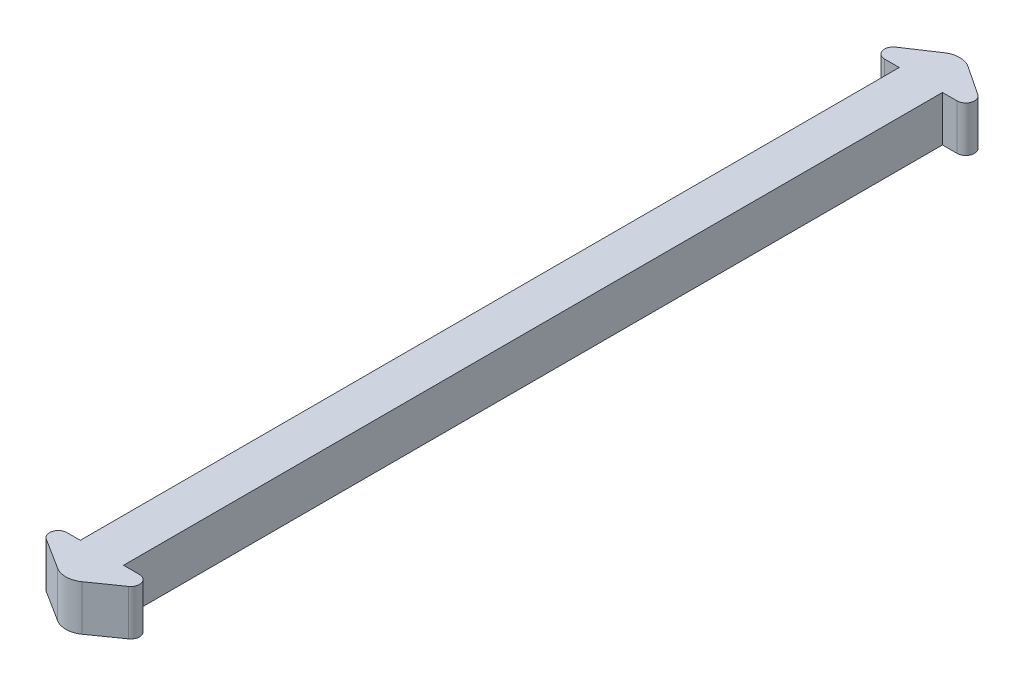
ISO-10303-21;
HEADER;
FILE_DESCRIPTION(('STEP AP214'),'2;1');
FILE_NAME('part.step','',(''),(''),'','','');
FILE_SCHEMA(('AUTOMOTIVE_DESIGN { 1 0 10303 214 1 1 1 1 }'));
ENDSEC;
DATA;
#1=APPLICATION_CONTEXT('core data for automotive mechanical design processes');
#2=APPLICATION_PROTOCOL_DEFINITION('international standard','automotive_design',2000,#1);
#3=PRODUCT_CONTEXT('',#1,'mechanical');
#4=PRODUCT('Part','Part','',(#3));
#5=PRODUCT_RELATED_PRODUCT_CATEGORY('part','',(#4));
#6=PRODUCT_DEFINITION_FORMATION('','',#4);
#7=PRODUCT_DEFINITION_CONTEXT('part definition',#1,'design');
#8=PRODUCT_DEFINITION('design','',#6,#7);
#9=PRODUCT_DEFINITION_SHAPE('','',#8);
#10=(LENGTH_UNIT() NAMED_UNIT(*) SI_UNIT(.MILLI.,.METRE.));
#11=(NAMED_UNIT(*) PLANE_ANGLE_UNIT() SI_UNIT($,.RADIAN.));
#12=(NAMED_UNIT(*) SI_UNIT($,.STERADIAN.) SOLID_ANGLE_UNIT());
#13=UNCERTAINTY_MEASURE_WITH_UNIT(LENGTH_MEASURE(1.E-05),#10,'distance_accuracy_value','');
#14=(GEOMETRIC_REPRESENTATION_CONTEXT(3) GLOBAL_UNCERTAINTY_ASSIGNED_CONTEXT((#13)) GLOBAL_UNIT_ASSIGNED_CONTEXT((#10,
#11,#12)) REPRESENTATION_CONTEXT('',''));
#15=CARTESIAN_POINT('',(0.,0.,0.));
#16=DIRECTION('',(0.,0.,1.));
#17=DIRECTION('',(1.,0.,0.));
#18=AXIS2_PLACEMENT_3D('',#15,#16,#17);
#19=CARTESIAN_POINT('',(6.25732834939996,10.,-9.38599252409994));
#20=DIRECTION('',(-0.554700196225229,0.,0.832050294337844));
#21=DIRECTION('',(0.832050294337844,0.,0.554700196225229));
#22=AXIS2_PLACEMENT_3D('',#19,#20,#21);
#23=PLANE('',#22);
#24=DIRECTION('',(-0.832050294337844,0.,-0.554700196225229));
#25=VECTOR('',#24,1.);
#26=CARTESIAN_POINT('',(6.25732834939996,0.,-9.38599252409994));
#27=LINE('',#26,#25);
#28=CARTESIAN_POINT('',(7.00116305499904,0.,-8.89010272036722));
#29=VERTEX_POINT('',#28);
#30=CARTESIAN_POINT('',(0.607332325931733,0.,-13.1526565397454));
#31=VERTEX_POINT('',#30);
#32=EDGE_CURVE('E200',#29,#31,#27,.T.);
#33=ORIENTED_EDGE('',*,*,#32,.T.);
#34=DIRECTION('',(0.,-1.,0.));
#35=VECTOR('',#34,1.);
#36=CARTESIAN_POINT('',(0.607332325931735,10.,-13.1526565397454));
#37=LINE('',#36,#35);
#38=CARTESIAN_POINT('',(0.607332325931733,10.,-13.1526565397454));
#39=VERTEX_POINT('',#38);
#40=EDGE_CURVE('E11',#31,#39,#37,.F.);
#41=ORIENTED_EDGE('',*,*,#40,.T.);
#42=DIRECTION('',(-0.832050294337844,0.,-0.554700196225229));
#43=VECTOR('',#42,1.);
#44=CARTESIAN_POINT('',(6.25732834939996,10.,-9.38599252409994));
#45=LINE('',#44,#43);
#46=CARTESIAN_POINT('',(7.00116305499904,10.,-8.89010272036722));
#47=VERTEX_POINT('',#46);
#48=EDGE_CURVE('E223',#47,#39,#45,.T.);
#49=ORIENTED_EDGE('',*,*,#48,.F.);
#50=DIRECTION('',(0.,-1.,0.));
#51=VECTOR('',#50,1.);
#52=CARTESIAN_POINT('',(7.00116305499904,10.,-8.89010272036722));
#53=LINE('',#52,#51);
#54=EDGE_CURVE('E256',#47,#29,#53,.T.);
#55=ORIENTED_EDGE('',*,*,#54,.T.);
#56=EDGE_LOOP('',(#33,#41,#49,#55));
#57=FACE_BOUND('',#56,.T.);
#58=ADVANCED_FACE('F41',(#57),#23,.F.);
#59=CARTESIAN_POINT('',(-7.50501672240802,10.,-11.257525083612));
#60=DIRECTION('',(-0.554700196225229,0.,-0.832050294337844));
#61=DIRECTION('',(-0.832050294337844,0.,0.554700196225229));
#62=AXIS2_PLACEMENT_3D('',#59,#60,#61);
#63=PLANE('',#62);
#64=DIRECTION('',(0.832050294337844,0.,-0.554700196225229));
#65=VECTOR('',#64,1.);
#66=CARTESIAN_POINT('',(-7.50501672240802,10.,-11.257525083612));
#67=LINE('',#66,#65);
#68=CARTESIAN_POINT('',(-11.0561502672752,10.,-8.89010272036722));
#69=VERTEX_POINT('',#68);
#70=CARTESIAN_POINT('',(-4.66231953820794,10.,-13.1526565397454));
#71=VERTEX_POINT('',#70);
#72=EDGE_CURVE('E167',#69,#71,#67,.T.);
#73=ORIENTED_EDGE('',*,*,#72,.T.);
#74=DIRECTION('',(0.,-1.,0.));
#75=VECTOR('',#74,1.);
#76=CARTESIAN_POINT('',(-4.66231953820794,0.,-13.1526565397454));
#77=LINE('',#76,#75);
#78=CARTESIAN_POINT('',(-4.66231953820794,0.,-13.1526565397454));
#79=VERTEX_POINT('',#78);
#80=EDGE_CURVE('E49',#71,#79,#77,.T.);
#81=ORIENTED_EDGE('',*,*,#80,.T.);
#82=DIRECTION('',(0.832050294337844,0.,-0.554700196225229));
#83=VECTOR('',#82,1.);
#84=CARTESIAN_POINT('',(-7.50501672240802,0.,-11.257525083612));
#85=LINE('',#84,#83);
#86=CARTESIAN_POINT('',(-11.0561502672752,0.,-8.89010272036722));
#87=VERTEX_POINT('',#86);
#88=EDGE_CURVE('E202',#87,#79,#85,.T.);
#89=ORIENTED_EDGE('',*,*,#88,.F.);
#90=DIRECTION('',(0.,-1.,0.));
#91=VECTOR('',#90,1.);
#92=CARTESIAN_POINT('',(-11.0561502672752,10.,-8.89010272036722));
#93=LINE('',#92,#91);
#94=EDGE_CURVE('E254',#87,#69,#93,.F.);
#95=ORIENTED_EDGE('',*,*,#94,.T.);
#96=EDGE_LOOP('',(#73,#81,#89,#95));
#97=FACE_BOUND('',#96,.T.);
#98=ADVANCED_FACE('F276',(#97),#63,.T.);
#99=CARTESIAN_POINT('',(0.,10.,-5.40920716112532));
#100=DIRECTION('',(0.,0.,-1.));
#101=DIRECTION('',(-1.,0.,0.));
#102=AXIS2_PLACEMENT_3D('',#99,#100,#101);
#103=PLANE('',#102);
#104=DIRECTION('',(1.,0.,0.));
#105=VECTOR('',#104,1.);
#106=CARTESIAN_POINT('',(0.,10.,-5.40920716112532));
#107=LINE('',#106,#105);
#108=CARTESIAN_POINT('',(-10.0022198944473,10.,-5.40920716112532));
#109=VERTEX_POINT('',#108);
#110=CARTESIAN_POINT('',(-6.7774936061381,10.,-5.40920716112532));
#111=VERTEX_POINT('',#110);
#112=EDGE_CURVE('E154',#109,#111,#107,.T.);
#113=ORIENTED_EDGE('',*,*,#112,.F.);
#114=DIRECTION('',(0.,-1.,0.));
#115=VECTOR('',#114,1.);
#116=CARTESIAN_POINT('',(-10.0022198944473,0.,-5.40920716112532));
#117=LINE('',#116,#115);
#118=CARTESIAN_POINT('',(-10.0022198944473,0.,-5.40920716112532));
#119=VERTEX_POINT('',#118);
#120=EDGE_CURVE('E252',#109,#119,#117,.T.);
#121=ORIENTED_EDGE('',*,*,#120,.T.);
#122=DIRECTION('',(1.,0.,0.));
#123=VECTOR('',#122,1.);
#124=CARTESIAN_POINT('',(0.,0.,-5.40920716112532));
#125=LINE('',#124,#123);
#126=CARTESIAN_POINT('',(-6.7774936061381,0.,-5.40920716112532));
#127=VERTEX_POINT('',#126);
#128=EDGE_CURVE('E173',#119,#127,#125,.T.);
#129=ORIENTED_EDGE('',*,*,#128,.T.);
#130=DIRECTION('',(0.,-1.,0.));
#131=VECTOR('',#130,1.);
#132=CARTESIAN_POINT('',(-6.7774936061381,10.,-5.40920716112532));
#133=LINE('',#132,#131);
#134=EDGE_CURVE('E170',#111,#127,#133,.T.);
#135=ORIENTED_EDGE('',*,*,#134,.F.);
#136=EDGE_LOOP('',(#113,#121,#129,#135));
#137=FACE_BOUND('',#136,.T.);
#138=ADVANCED_FACE('F171',(#137),#103,.F.);
#139=CARTESIAN_POINT('',(-6.7774936061381,10.,0.));
#140=DIRECTION('',(1.,0.,0.));
#141=DIRECTION('',(0.,0.,-1.));
#142=AXIS2_PLACEMENT_3D('',#139,#140,#141);
#143=PLANE('',#142);
#144=DIRECTION('',(0.,0.,1.));
#145=VECTOR('',#144,1.);
#146=CARTESIAN_POINT('',(-6.7774936061381,0.,0.));
#147=LINE('',#146,#145);
#148=CARTESIAN_POINT('',(-6.77749360613808,0.,174.590792838875));
#149=VERTEX_POINT('',#148);
#150=EDGE_CURVE('E206',#127,#149,#147,.T.);
#151=ORIENTED_EDGE('',*,*,#150,.T.);
#152=DIRECTION('',(0.,-1.,0.));
#153=VECTOR('',#152,1.);
#154=CARTESIAN_POINT('',(-6.77749360613808,10.,174.590792838875));
#155=LINE('',#154,#153);
#156=CARTESIAN_POINT('',(-6.77749360613808,10.,174.590792838875));
#157=VERTEX_POINT('',#156);
#158=EDGE_CURVE('E178',#157,#149,#155,.T.);
#159=ORIENTED_EDGE('',*,*,#158,.F.);
#160=DIRECTION('',(0.,0.,1.));
#161=VECTOR('',#160,1.);
#162=CARTESIAN_POINT('',(-6.7774936061381,10.,0.));
#163=LINE('',#162,#161);
#164=EDGE_CURVE('E160',#111,#157,#163,.T.);
#165=ORIENTED_EDGE('',*,*,#164,.F.);
#166=ORIENTED_EDGE('',*,*,#134,.T.);
#167=EDGE_LOOP('',(#151,#159,#165,#166));
#168=FACE_BOUND('',#167,.T.);
#169=ADVANCED_FACE('F180',(#168),#143,.F.);
#170=CARTESIAN_POINT('',(0.,10.,174.590792838875));
#171=DIRECTION('',(0.,0.,-1.));
#172=DIRECTION('',(-1.,0.,0.));
#173=AXIS2_PLACEMENT_3D('',#170,#171,#172);
#174=PLANE('',#173);
#175=DIRECTION('',(1.,0.,0.));
#176=VECTOR('',#175,1.);
#177=CARTESIAN_POINT('',(0.,0.,174.590792838875));
#178=LINE('',#177,#176);
#179=CARTESIAN_POINT('',(-9.72643742522514,0.,174.590792838875));
#180=VERTEX_POINT('',#179);
#181=EDGE_CURVE('E208',#180,#149,#178,.T.);
#182=ORIENTED_EDGE('',*,*,#181,.F.);
#183=DIRECTION('',(0.,-1.,0.));
#184=VECTOR('',#183,1.);
#185=CARTESIAN_POINT('',(-9.72643742522514,10.,174.590792838875));
#186=LINE('',#185,#184);
#187=CARTESIAN_POINT('',(-9.72643742522514,10.,174.590792838875));
#188=VERTEX_POINT('',#187);
#189=EDGE_CURVE('E250',#180,#188,#186,.F.);
#190=ORIENTED_EDGE('',*,*,#189,.T.);
#191=DIRECTION('',(1.,0.,0.));
#192=VECTOR('',#191,1.);
#193=CARTESIAN_POINT('',(0.,10.,174.590792838875));
#194=LINE('',#193,#192);
#195=EDGE_CURVE('E182',#188,#157,#194,.T.);
#196=ORIENTED_EDGE('',*,*,#195,.T.);
#197=ORIENTED_EDGE('',*,*,#158,.T.);
#198=EDGE_LOOP('',(#182,#190,#196,#197));
#199=FACE_BOUND('',#198,.T.);
#200=ADVANCED_FACE('F350',(#199),#174,.T.);
#201=CARTESIAN_POINT('',(-83.5788478271011,10.,131.966601832265));
#202=DIRECTION('',(0.535052081184345,0.,-0.844819075554228));
#203=DIRECTION('',(-0.844819075554228,0.,-0.535052081184345));
#204=AXIS2_PLACEMENT_3D('',#201,#202,#203);
#205=PLANE('',#204);
#206=DIRECTION('',(0.844819075554228,0.,0.535052081184345));
#207=VECTOR('',#206,1.);
#208=CARTESIAN_POINT('',(-83.5788478271011,0.,131.966601832265));
#209=LINE('',#208,#207);
#210=CARTESIAN_POINT('',(-10.7430363794754,0.,178.095949082428));
#211=VERTEX_POINT('',#210);
#212=CARTESIAN_POINT('',(-3.9578913088982,0.,182.393207627127));
#213=VERTEX_POINT('',#212);
#214=EDGE_CURVE('E210',#211,#213,#209,.T.);
#215=ORIENTED_EDGE('',*,*,#214,.T.);
#216=DIRECTION('',(0.,-1.,0.));
#217=VECTOR('',#216,1.);
#218=CARTESIAN_POINT('',(-3.9578913088982,10.,182.393207627127));
#219=LINE('',#218,#217);
#220=CARTESIAN_POINT('',(-3.9578913088982,10.,182.393207627127));
#221=VERTEX_POINT('',#220);
#222=EDGE_CURVE('E268',#213,#221,#219,.F.);
#223=ORIENTED_EDGE('',*,*,#222,.T.);
#224=DIRECTION('',(0.844819075554228,0.,0.535052081184345));
#225=VECTOR('',#224,1.);
#226=CARTESIAN_POINT('',(-83.5788478271011,10.,131.966601832265));
#227=LINE('',#226,#225);
#228=CARTESIAN_POINT('',(-10.7430363794754,10.,178.095949082428));
#229=VERTEX_POINT('',#228);
#230=EDGE_CURVE('E184',#229,#221,#227,.T.);
#231=ORIENTED_EDGE('',*,*,#230,.F.);
#232=DIRECTION('',(0.,-1.,0.));
#233=VECTOR('',#232,1.);
#234=CARTESIAN_POINT('',(-10.7430363794754,0.,178.095949082428));
#235=LINE('',#234,#233);
#236=EDGE_CURVE('E247',#229,#211,#235,.T.);
#237=ORIENTED_EDGE('',*,*,#236,.T.);
#238=EDGE_LOOP('',(#215,#223,#231,#237));
#239=FACE_BOUND('',#238,.T.);
#240=ADVANCED_FACE('F344',(#239),#205,.F.);
#241=CARTESIAN_POINT('',(86.2177995729605,10.,122.520030972102));
#242=DIRECTION('',(0.575493406174614,0.,0.817806419300766));
#243=DIRECTION('',(0.817806419300766,0.,-0.575493406174614));
#244=AXIS2_PLACEMENT_3D('',#241,#242,#243);
#245=PLANE('',#244);
#246=DIRECTION('',(-0.817806419300766,0.,0.575493406174614));
#247=VECTOR('',#246,1.);
#248=CARTESIAN_POINT('',(86.2177995729605,10.,122.520030972102));
#249=LINE('',#248,#247);
#250=CARTESIAN_POINT('',(7.3144290617498,10.,178.044625035546));
#251=VERTEX_POINT('',#250);
#252=CARTESIAN_POINT('',(1.31719975605685,10.,182.264897509923));
#253=VERTEX_POINT('',#252);
#254=EDGE_CURVE('E190',#251,#253,#249,.T.);
#255=ORIENTED_EDGE('',*,*,#254,.T.);
#256=DIRECTION('',(0.,-1.,0.));
#257=VECTOR('',#256,1.);
#258=CARTESIAN_POINT('',(1.31719975605686,0.,182.264897509923));
#259=LINE('',#258,#257);
#260=CARTESIAN_POINT('',(1.31719975605685,0.,182.264897509923));
#261=VERTEX_POINT('',#260);
#262=EDGE_CURVE('E261',#253,#261,#259,.T.);
#263=ORIENTED_EDGE('',*,*,#262,.T.);
#264=DIRECTION('',(-0.817806419300766,0.,0.575493406174614));
#265=VECTOR('',#264,1.);
#266=CARTESIAN_POINT('',(86.2177995729605,0.,122.520030972102));
#267=LINE('',#266,#265);
#268=CARTESIAN_POINT('',(7.3144290617498,0.,178.044625035546));
#269=VERTEX_POINT('',#268);
#270=EDGE_CURVE('E214',#269,#261,#267,.T.);
#271=ORIENTED_EDGE('',*,*,#270,.F.);
#272=DIRECTION('',(0.,-1.,0.));
#273=VECTOR('',#272,1.);
#274=CARTESIAN_POINT('',(7.31442906174982,10.,178.044625035546));
#275=LINE('',#274,#273);
#276=EDGE_CURVE('E238',#269,#251,#275,.F.);
#277=ORIENTED_EDGE('',*,*,#276,.T.);
#278=EDGE_LOOP('',(#255,#263,#271,#277));
#279=FACE_BOUND('',#278,.T.);
#280=ADVANCED_FACE('F337',(#279),#245,.T.);
#281=CARTESIAN_POINT('',(2.72250639386192,10.,174.590792838875));
#282=VERTEX_POINT('',#281);
#283=CARTESIAN_POINT('',(6.22099159001805,10.,174.590792838875));
#284=VERTEX_POINT('',#283);
#285=EDGE_CURVE('E186',#282,#284,#194,.T.);
#286=ORIENTED_EDGE('',*,*,#285,.T.);
#287=DIRECTION('',(0.,-1.,0.));
#288=VECTOR('',#287,1.);
#289=CARTESIAN_POINT('',(6.22099159001805,10.,174.590792838875));
#290=LINE('',#289,#288);
#291=CARTESIAN_POINT('',(6.22099159001805,0.,174.590792838875));
#292=VERTEX_POINT('',#291);
#293=EDGE_CURVE('E177',#284,#292,#290,.T.);
#294=ORIENTED_EDGE('',*,*,#293,.T.);
#295=CARTESIAN_POINT('',(2.72250639386192,0.,174.590792838875));
#296=VERTEX_POINT('',#295);
#297=EDGE_CURVE('E211',#296,#292,#178,.T.);
#298=ORIENTED_EDGE('',*,*,#297,.F.);
#299=DIRECTION('',(0.,-1.,0.));
#300=VECTOR('',#299,1.);
#301=CARTESIAN_POINT('',(2.72250639386192,10.,174.590792838875));
#302=LINE('',#301,#300);
#303=EDGE_CURVE('E225',#282,#296,#302,.T.);
#304=ORIENTED_EDGE('',*,*,#303,.F.);
#305=EDGE_LOOP('',(#286,#294,#298,#304));
#306=FACE_BOUND('',#305,.T.);
#307=ADVANCED_FACE('F330',(#306),#174,.T.);
#308=CARTESIAN_POINT('',(2.7225063938619,10.,0.));
#309=DIRECTION('',(1.,0.,0.));
#310=DIRECTION('',(0.,0.,-1.));
#311=AXIS2_PLACEMENT_3D('',#308,#309,#310);
#312=PLANE('',#311);
#313=DIRECTION('',(0.,0.,1.));
#314=VECTOR('',#313,1.);
#315=CARTESIAN_POINT('',(2.7225063938619,0.,0.));
#316=LINE('',#315,#314);
#317=CARTESIAN_POINT('',(2.7225063938619,0.,-5.40920716112532));
#318=VERTEX_POINT('',#317);
#319=EDGE_CURVE('E217',#318,#296,#316,.T.);
#320=ORIENTED_EDGE('',*,*,#319,.F.);
#321=DIRECTION('',(0.,-1.,0.));
#322=VECTOR('',#321,1.);
#323=CARTESIAN_POINT('',(2.7225063938619,10.,-5.40920716112532));
#324=LINE('',#323,#322);
#325=CARTESIAN_POINT('',(2.7225063938619,10.,-5.40920716112532));
#326=VERTEX_POINT('',#325);
#327=EDGE_CURVE('E199',#326,#318,#324,.T.);
#328=ORIENTED_EDGE('',*,*,#327,.F.);
#329=DIRECTION('',(0.,0.,1.));
#330=VECTOR('',#329,1.);
#331=CARTESIAN_POINT('',(2.7225063938619,10.,0.));
#332=LINE('',#331,#330);
#333=EDGE_CURVE('E193',#326,#282,#332,.T.);
#334=ORIENTED_EDGE('',*,*,#333,.T.);
#335=ORIENTED_EDGE('',*,*,#303,.T.);
#336=EDGE_LOOP('',(#320,#328,#334,#335));
#337=FACE_BOUND('',#336,.T.);
#338=ADVANCED_FACE('F324',(#337),#312,.T.);
#339=CARTESIAN_POINT('',(0.,10.,-5.40920716112532));
#340=DIRECTION('',(0.,0.,-1.));
#341=DIRECTION('',(-1.,0.,0.));
#342=AXIS2_PLACEMENT_3D('',#339,#340,#341);
#343=PLANE('',#342);
#344=DIRECTION('',(1.,0.,0.));
#345=VECTOR('',#344,1.);
#346=CARTESIAN_POINT('',(0.,0.,-5.40920716112532));
#347=LINE('',#346,#345);
#348=CARTESIAN_POINT('',(5.9472326821711,0.,-5.40920716112532));
#349=VERTEX_POINT('',#348);
#350=EDGE_CURVE('E220',#318,#349,#347,.T.);
#351=ORIENTED_EDGE('',*,*,#350,.T.);
#352=DIRECTION('',(0.,-1.,0.));
#353=VECTOR('',#352,1.);
#354=CARTESIAN_POINT('',(5.9472326821711,10.,-5.40920716112532));
#355=LINE('',#354,#353);
#356=CARTESIAN_POINT('',(5.9472326821711,10.,-5.40920716112532));
#357=VERTEX_POINT('',#356);
#358=EDGE_CURVE('E259',#349,#357,#355,.F.);
#359=ORIENTED_EDGE('',*,*,#358,.T.);
#360=DIRECTION('',(1.,0.,0.));
#361=VECTOR('',#360,1.);
#362=CARTESIAN_POINT('',(0.,10.,-5.40920716112532));
#363=LINE('',#362,#361);
#364=EDGE_CURVE('E196',#326,#357,#363,.T.);
#365=ORIENTED_EDGE('',*,*,#364,.F.);
#366=ORIENTED_EDGE('',*,*,#327,.T.);
#367=EDGE_LOOP('',(#351,#359,#365,#366));
#368=FACE_BOUND('',#367,.T.);
#369=ADVANCED_FACE('F320',(#368),#343,.F.);
#370=CARTESIAN_POINT('',(0.,10.,0.));
#371=DIRECTION('',(0.,1.,0.));
#372=DIRECTION('',(0.,0.,1.));
#373=AXIS2_PLACEMENT_3D('',#370,#371,#372);
#374=PLANE('',#373);
#375=ORIENTED_EDGE('',*,*,#230,.T.);
#376=CARTESIAN_POINT('',(-1.41639392327257,10.,178.380317018244));
#377=DIRECTION('',(0.,1.,0.));
#378=DIRECTION('',(0.,0.,1.));
#379=AXIS2_PLACEMENT_3D('',#376,#377,#378);
#380=CIRCLE('',#379,4.75);
#381=EDGE_CURVE('E271',#221,#253,#380,.T.);
#382=ORIENTED_EDGE('',*,*,#381,.T.);
#383=ORIENTED_EDGE('',*,*,#254,.F.);
#384=CARTESIAN_POINT('',(6.22099159001805,10.,176.490792838875));
#385=DIRECTION('',(0.,1.,0.));
#386=DIRECTION('',(0.,0.,1.));
#387=AXIS2_PLACEMENT_3D('',#384,#385,#386);
#388=CIRCLE('',#387,1.9);
#389=EDGE_CURVE('E245',#251,#284,#388,.T.);
#390=ORIENTED_EDGE('',*,*,#389,.T.);
#391=ORIENTED_EDGE('',*,*,#285,.F.);
#392=ORIENTED_EDGE('',*,*,#333,.F.);
#393=ORIENTED_EDGE('',*,*,#364,.T.);
#394=CARTESIAN_POINT('',(5.9472326821711,10.,-7.30920716112532));
#395=DIRECTION('',(0.,1.,0.));
#396=DIRECTION('',(0.,0.,1.));
#397=AXIS2_PLACEMENT_3D('',#394,#395,#396);
#398=CIRCLE('',#397,1.9);
#399=EDGE_CURVE('E240',#357,#47,#398,.T.);
#400=ORIENTED_EDGE('',*,*,#399,.T.);
#401=ORIENTED_EDGE('',*,*,#48,.T.);
#402=CARTESIAN_POINT('',(-2.0274936061381,10.,-9.20041764164067));
#403=DIRECTION('',(0.,1.,0.));
#404=DIRECTION('',(0.,0.,1.));
#405=AXIS2_PLACEMENT_3D('',#402,#403,#404);
#406=CIRCLE('',#405,4.75);
#407=EDGE_CURVE('E56',#39,#71,#406,.T.);
#408=ORIENTED_EDGE('',*,*,#407,.T.);
#409=ORIENTED_EDGE('',*,*,#72,.F.);
#410=CARTESIAN_POINT('',(-10.0022198944473,10.,-7.30920716112532));
#411=DIRECTION('',(0.,1.,0.));
#412=DIRECTION('',(0.,0.,1.));
#413=AXIS2_PLACEMENT_3D('',#410,#411,#412);
#414=CIRCLE('',#413,1.9);
#415=EDGE_CURVE('E163',#69,#109,#414,.T.);
#416=ORIENTED_EDGE('',*,*,#415,.T.);
#417=ORIENTED_EDGE('',*,*,#112,.T.);
#418=ORIENTED_EDGE('',*,*,#164,.T.);
#419=ORIENTED_EDGE('',*,*,#195,.F.);
#420=CARTESIAN_POINT('',(-9.72643742522514,10.,176.490792838875));
#421=DIRECTION('',(0.,1.,0.));
#422=DIRECTION('',(0.,0.,1.));
#423=AXIS2_PLACEMENT_3D('',#420,#421,#422);
#424=CIRCLE('',#423,1.9);
#425=EDGE_CURVE('E243',#188,#229,#424,.T.);
#426=ORIENTED_EDGE('',*,*,#425,.T.);
#427=EDGE_LOOP('',(#375,#382,#383,#390,#391,#392,#393,#400,#401,#408,#409,#416,#417,#418,#419,#426));
#428=FACE_BOUND('',#427,.T.);
#429=ADVANCED_FACE('F157',(#428),#374,.T.);
#430=CARTESIAN_POINT('',(0.,0.,0.));
#431=DIRECTION('',(0.,1.,0.));
#432=DIRECTION('',(0.,0.,1.));
#433=AXIS2_PLACEMENT_3D('',#430,#431,#432);
#434=PLANE('',#433);
#435=ORIENTED_EDGE('',*,*,#270,.T.);
#436=CARTESIAN_POINT('',(-1.41639392327257,0.,178.380317018244));
#437=DIRECTION('',(0.,1.,0.));
#438=DIRECTION('',(0.,0.,1.));
#439=AXIS2_PLACEMENT_3D('',#436,#437,#438);
#440=CIRCLE('',#439,4.75);
#441=EDGE_CURVE('E266',#261,#213,#440,.F.);
#442=ORIENTED_EDGE('',*,*,#441,.T.);
#443=ORIENTED_EDGE('',*,*,#214,.F.);
#444=CARTESIAN_POINT('',(-9.72643742522514,0.,176.490792838875));
#445=DIRECTION('',(0.,1.,0.));
#446=DIRECTION('',(0.,0.,1.));
#447=AXIS2_PLACEMENT_3D('',#444,#445,#446);
#448=CIRCLE('',#447,1.9);
#449=EDGE_CURVE('E234',#211,#180,#448,.F.);
#450=ORIENTED_EDGE('',*,*,#449,.T.);
#451=ORIENTED_EDGE('',*,*,#181,.T.);
#452=ORIENTED_EDGE('',*,*,#150,.F.);
#453=ORIENTED_EDGE('',*,*,#128,.F.);
#454=CARTESIAN_POINT('',(-10.0022198944473,0.,-7.30920716112532));
#455=DIRECTION('',(0.,1.,0.));
#456=DIRECTION('',(0.,0.,1.));
#457=AXIS2_PLACEMENT_3D('',#454,#455,#456);
#458=CIRCLE('',#457,1.9);
#459=EDGE_CURVE('E232',#119,#87,#458,.F.);
#460=ORIENTED_EDGE('',*,*,#459,.T.);
#461=ORIENTED_EDGE('',*,*,#88,.T.);
#462=CARTESIAN_POINT('',(-2.0274936061381,0.,-9.20041764164067));
#463=DIRECTION('',(0.,1.,0.));
#464=DIRECTION('',(0.,0.,1.));
#465=AXIS2_PLACEMENT_3D('',#462,#463,#464);
#466=CIRCLE('',#465,4.75);
#467=EDGE_CURVE('E264',#79,#31,#466,.F.);
#468=ORIENTED_EDGE('',*,*,#467,.T.);
#469=ORIENTED_EDGE('',*,*,#32,.F.);
#470=CARTESIAN_POINT('',(5.9472326821711,0.,-7.30920716112532));
#471=DIRECTION('',(0.,1.,0.));
#472=DIRECTION('',(0.,0.,1.));
#473=AXIS2_PLACEMENT_3D('',#470,#471,#472);
#474=CIRCLE('',#473,1.9);
#475=EDGE_CURVE('E230',#29,#349,#474,.F.);
#476=ORIENTED_EDGE('',*,*,#475,.T.);
#477=ORIENTED_EDGE('',*,*,#350,.F.);
#478=ORIENTED_EDGE('',*,*,#319,.T.);
#479=ORIENTED_EDGE('',*,*,#297,.T.);
#480=CARTESIAN_POINT('',(6.22099159001805,0.,176.490792838875));
#481=DIRECTION('',(0.,1.,0.));
#482=DIRECTION('',(0.,0.,1.));
#483=AXIS2_PLACEMENT_3D('',#480,#481,#482);
#484=CIRCLE('',#483,1.9);
#485=EDGE_CURVE('E236',#292,#269,#484,.F.);
#486=ORIENTED_EDGE('',*,*,#485,.T.);
#487=EDGE_LOOP('',(#435,#442,#443,#450,#451,#452,#453,#460,#461,#468,#469,#476,#477,#478,#479,#486));
#488=FACE_BOUND('',#487,.T.);
#489=ADVANCED_FACE('F280',(#488),#434,.F.);
#490=CARTESIAN_POINT('',(6.22099159001805,10.,176.490792838875));
#491=DIRECTION('',(0.,-1.,0.));
#492=DIRECTION('',(0.,0.,-1.));
#493=AXIS2_PLACEMENT_3D('',#490,#491,#492);
#494=CYLINDRICAL_SURFACE('',#493,1.9);
#495=ORIENTED_EDGE('',*,*,#389,.F.);
#496=ORIENTED_EDGE('',*,*,#276,.F.);
#497=ORIENTED_EDGE('',*,*,#485,.F.);
#498=ORIENTED_EDGE('',*,*,#293,.F.);
#499=EDGE_LOOP('',(#495,#496,#497,#498));
#500=FACE_BOUND('',#499,.T.);
#501=ADVANCED_FACE('F303',(#500),#494,.T.);
#502=CARTESIAN_POINT('',(-9.72643742522514,10.,176.490792838875));
#503=DIRECTION('',(0.,1.,0.));
#504=DIRECTION('',(0.,0.,1.));
#505=AXIS2_PLACEMENT_3D('',#502,#503,#504);
#506=CYLINDRICAL_SURFACE('',#505,1.9);
#507=ORIENTED_EDGE('',*,*,#425,.F.);
#508=ORIENTED_EDGE('',*,*,#189,.F.);
#509=ORIENTED_EDGE('',*,*,#449,.F.);
#510=ORIENTED_EDGE('',*,*,#236,.F.);
#511=EDGE_LOOP('',(#507,#508,#509,#510));
#512=FACE_BOUND('',#511,.T.);
#513=ADVANCED_FACE('F306',(#512),#506,.T.);
#514=CARTESIAN_POINT('',(-10.0022198944473,10.,-7.30920716112532));
#515=DIRECTION('',(0.,1.,0.));
#516=DIRECTION('',(0.,0.,1.));
#517=AXIS2_PLACEMENT_3D('',#514,#515,#516);
#518=CYLINDRICAL_SURFACE('',#517,1.9);
#519=ORIENTED_EDGE('',*,*,#415,.F.);
#520=ORIENTED_EDGE('',*,*,#94,.F.);
#521=ORIENTED_EDGE('',*,*,#459,.F.);
#522=ORIENTED_EDGE('',*,*,#120,.F.);
#523=EDGE_LOOP('',(#519,#520,#521,#522));
#524=FACE_BOUND('',#523,.T.);
#525=ADVANCED_FACE('F283',(#524),#518,.T.);
#526=CARTESIAN_POINT('',(5.9472326821711,10.,-7.30920716112532));
#527=DIRECTION('',(0.,-1.,0.));
#528=DIRECTION('',(0.,0.,-1.));
#529=AXIS2_PLACEMENT_3D('',#526,#527,#528);
#530=CYLINDRICAL_SURFACE('',#529,1.9);
#531=ORIENTED_EDGE('',*,*,#399,.F.);
#532=ORIENTED_EDGE('',*,*,#358,.F.);
#533=ORIENTED_EDGE('',*,*,#475,.F.);
#534=ORIENTED_EDGE('',*,*,#54,.F.);
#535=EDGE_LOOP('',(#531,#532,#533,#534));
#536=FACE_BOUND('',#535,.T.);
#537=ADVANCED_FACE('F292',(#536),#530,.T.);
#538=CARTESIAN_POINT('',(-1.41639392327257,10.,178.380317018244));
#539=DIRECTION('',(0.,1.,0.));
#540=DIRECTION('',(0.,0.,1.));
#541=AXIS2_PLACEMENT_3D('',#538,#539,#540);
#542=CYLINDRICAL_SURFACE('',#541,4.75);
#543=ORIENTED_EDGE('',*,*,#381,.F.);
#544=ORIENTED_EDGE('',*,*,#222,.F.);
#545=ORIENTED_EDGE('',*,*,#441,.F.);
#546=ORIENTED_EDGE('',*,*,#262,.F.);
#547=EDGE_LOOP('',(#543,#544,#545,#546));
#548=FACE_BOUND('',#547,.T.);
#549=ADVANCED_FACE('F288',(#548),#542,.T.);
#550=CARTESIAN_POINT('',(-2.0274936061381,10.,-9.20041764164067));
#551=DIRECTION('',(0.,1.,0.));
#552=DIRECTION('',(0.,0.,1.));
#553=AXIS2_PLACEMENT_3D('',#550,#551,#552);
#554=CYLINDRICAL_SURFACE('',#553,4.75);
#555=ORIENTED_EDGE('',*,*,#407,.F.);
#556=ORIENTED_EDGE('',*,*,#40,.F.);
#557=ORIENTED_EDGE('',*,*,#467,.F.);
#558=ORIENTED_EDGE('',*,*,#80,.F.);
#559=EDGE_LOOP('',(#555,#556,#557,#558));
#560=FACE_BOUND('',#559,.T.);
#561=ADVANCED_FACE('F43',(#560),#554,.T.);
#562=CLOSED_SHELL('',(#58,#98,#138,#169,#200,#240,#280,#307,#338,#369,#429,#489,#501,#513,#525,
#537,#549,#561));
#563=MANIFOLD_SOLID_BREP('B2',#562);
#564=ADVANCED_BREP_SHAPE_REPRESENTATION('',(#18,#563),#14);
#565=SHAPE_DEFINITION_REPRESENTATION(#9,#564);
ENDSEC;
END-ISO-10303-21;
